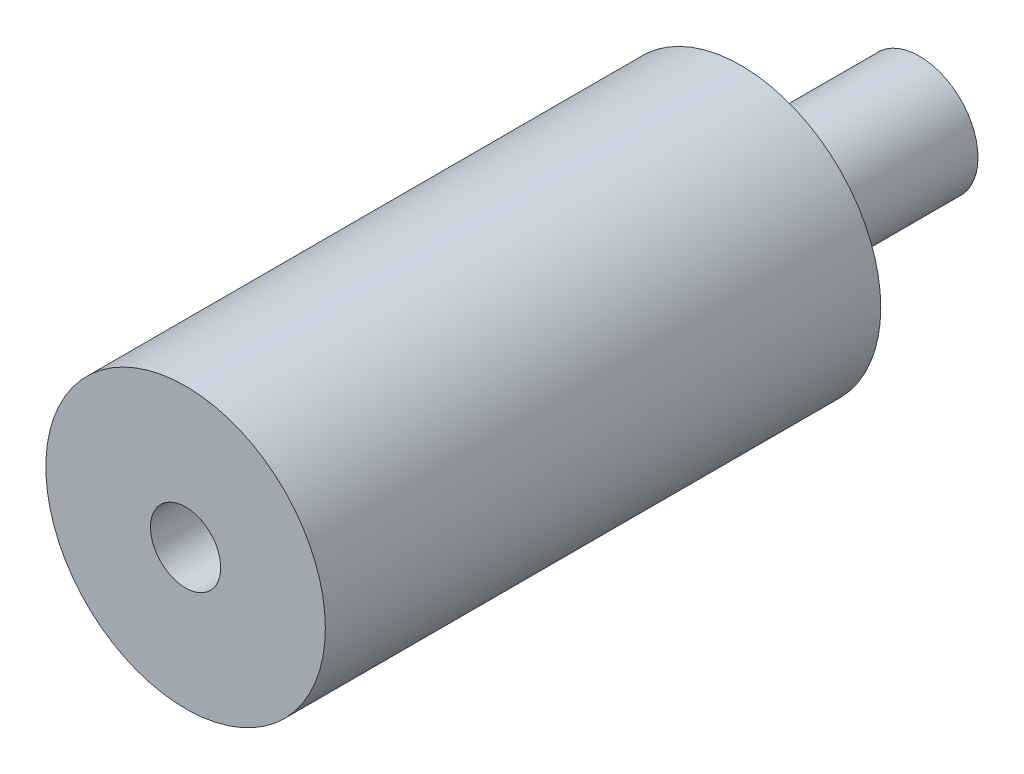
ISO-10303-21;
HEADER;
FILE_DESCRIPTION(('STEP AP214'),'2;1');
FILE_NAME('part.step','',(''),(''),'','','');
FILE_SCHEMA(('AUTOMOTIVE_DESIGN { 1 0 10303 214 1 1 1 1 }'));
ENDSEC;
DATA;
#1=APPLICATION_CONTEXT('core data for automotive mechanical design processes');
#2=APPLICATION_PROTOCOL_DEFINITION('international standard','automotive_design',2000,#1);
#3=PRODUCT_CONTEXT('',#1,'mechanical');
#4=PRODUCT('Part','Part','',(#3));
#5=PRODUCT_RELATED_PRODUCT_CATEGORY('part','',(#4));
#6=PRODUCT_DEFINITION_FORMATION('','',#4);
#7=PRODUCT_DEFINITION_CONTEXT('part definition',#1,'design');
#8=PRODUCT_DEFINITION('design','',#6,#7);
#9=PRODUCT_DEFINITION_SHAPE('','',#8);
#10=(LENGTH_UNIT() NAMED_UNIT(*) SI_UNIT(.MILLI.,.METRE.));
#11=(NAMED_UNIT(*) PLANE_ANGLE_UNIT() SI_UNIT($,.RADIAN.));
#12=(NAMED_UNIT(*) SI_UNIT($,.STERADIAN.) SOLID_ANGLE_UNIT());
#13=UNCERTAINTY_MEASURE_WITH_UNIT(LENGTH_MEASURE(1.E-05),#10,'distance_accuracy_value','');
#14=(GEOMETRIC_REPRESENTATION_CONTEXT(3) GLOBAL_UNCERTAINTY_ASSIGNED_CONTEXT((#13)) GLOBAL_UNIT_ASSIGNED_CONTEXT((#10,
#11,#12)) REPRESENTATION_CONTEXT('',''));
#15=CARTESIAN_POINT('',(0.,0.,0.));
#16=DIRECTION('',(0.,0.,1.));
#17=DIRECTION('',(1.,0.,0.));
#18=AXIS2_PLACEMENT_3D('',#15,#16,#17);
#19=CARTESIAN_POINT('',(0.,0.,0.));
#20=DIRECTION('',(0.,0.,1.));
#21=DIRECTION('',(1.,0.,0.));
#22=AXIS2_PLACEMENT_3D('',#19,#20,#21);
#23=PLANE('',#22);
#24=CARTESIAN_POINT('',(0.,0.,0.));
#25=DIRECTION('',(0.,0.,1.));
#26=DIRECTION('',(1.,0.,0.));
#27=AXIS2_PLACEMENT_3D('',#24,#25,#26);
#28=CIRCLE('',#27,5.969);
#29=CARTESIAN_POINT('',(5.969,0.,0.));
#30=VERTEX_POINT('',#29);
#31=EDGE_CURVE('E369',#30,#30,#28,.T.);
#32=ORIENTED_EDGE('',*,*,#31,.F.);
#33=EDGE_LOOP('',(#32));
#34=FACE_BOUND('',#33,.T.);
#35=CARTESIAN_POINT('',(0.,0.,0.));
#36=DIRECTION('',(0.,0.,1.));
#37=DIRECTION('',(1.,0.,0.));
#38=AXIS2_PLACEMENT_3D('',#35,#36,#37);
#39=CIRCLE('',#38,2.5019);
#40=CARTESIAN_POINT('',(2.5019,0.,0.));
#41=VERTEX_POINT('',#40);
#42=EDGE_CURVE('E10',#41,#41,#39,.F.);
#43=ORIENTED_EDGE('',*,*,#42,.F.);
#44=EDGE_LOOP('',(#43));
#45=FACE_BOUND('',#44,.T.);
#46=ADVANCED_FACE('F358',(#34,#45),#23,.F.);
#47=CARTESIAN_POINT('',(0.,0.,23.7236));
#48=DIRECTION('',(0.,0.,1.));
#49=DIRECTION('',(1.,0.,0.));
#50=AXIS2_PLACEMENT_3D('',#47,#48,#49);
#51=PLANE('',#50);
#52=CARTESIAN_POINT('',(0.,0.,23.7236));
#53=DIRECTION('',(0.,0.,1.));
#54=DIRECTION('',(1.,0.,0.));
#55=AXIS2_PLACEMENT_3D('',#52,#53,#54);
#56=CIRCLE('',#55,5.969);
#57=CARTESIAN_POINT('',(5.969,0.,23.7236));
#58=VERTEX_POINT('',#57);
#59=EDGE_CURVE('E365',#58,#58,#56,.T.);
#60=ORIENTED_EDGE('',*,*,#59,.T.);
#61=EDGE_LOOP('',(#60));
#62=FACE_BOUND('',#61,.T.);
#63=CARTESIAN_POINT('',(0.,0.,23.7236));
#64=DIRECTION('',(0.,0.,1.));
#65=DIRECTION('',(1.,0.,0.));
#66=AXIS2_PLACEMENT_3D('',#63,#64,#65);
#67=CIRCLE('',#66,1.5);
#68=CARTESIAN_POINT('',(1.5,0.,23.7236));
#69=VERTEX_POINT('',#68);
#70=EDGE_CURVE('E373',#69,#69,#67,.T.);
#71=ORIENTED_EDGE('',*,*,#70,.F.);
#72=EDGE_LOOP('',(#71));
#73=FACE_BOUND('',#72,.T.);
#74=ADVANCED_FACE('F401',(#62,#73),#51,.T.);
#75=CARTESIAN_POINT('',(0.,0.,23.7236));
#76=DIRECTION('',(0.,0.,-1.));
#77=DIRECTION('',(-1.,0.,0.));
#78=AXIS2_PLACEMENT_3D('',#75,#76,#77);
#79=CYLINDRICAL_SURFACE('',#78,5.969);
#80=ORIENTED_EDGE('',*,*,#59,.F.);
#81=EDGE_LOOP('',(#80));
#82=FACE_BOUND('',#81,.T.);
#83=ORIENTED_EDGE('',*,*,#31,.T.);
#84=EDGE_LOOP('',(#83));
#85=FACE_BOUND('',#84,.T.);
#86=ADVANCED_FACE('F360',(#82,#85),#79,.T.);
#87=CARTESIAN_POINT('',(0.,0.,23.7236));
#88=DIRECTION('',(0.,0.,-1.));
#89=DIRECTION('',(-1.,0.,0.));
#90=AXIS2_PLACEMENT_3D('',#87,#88,#89);
#91=CYLINDRICAL_SURFACE('',#90,1.5);
#92=ORIENTED_EDGE('',*,*,#70,.T.);
#93=EDGE_LOOP('',(#92));
#94=FACE_BOUND('',#93,.T.);
#95=CARTESIAN_POINT('',(0.,0.,-7.62));
#96=DIRECTION('',(0.,0.,-1.));
#97=DIRECTION('',(-1.,0.,0.));
#98=AXIS2_PLACEMENT_3D('',#95,#96,#97);
#99=CIRCLE('',#98,1.5);
#100=CARTESIAN_POINT('',(-1.5,0.,-7.62));
#101=VERTEX_POINT('',#100);
#102=EDGE_CURVE('E381',#101,#101,#99,.T.);
#103=ORIENTED_EDGE('',*,*,#102,.T.);
#104=EDGE_LOOP('',(#103));
#105=FACE_BOUND('',#104,.T.);
#106=ADVANCED_FACE('F385',(#94,#105),#91,.F.);
#107=CARTESIAN_POINT('',(0.,0.,-7.62));
#108=DIRECTION('',(0.,0.,-1.));
#109=DIRECTION('',(-1.,0.,0.));
#110=AXIS2_PLACEMENT_3D('',#107,#108,#109);
#111=PLANE('',#110);
#112=CARTESIAN_POINT('',(0.,0.,-7.62));
#113=DIRECTION('',(0.,0.,-1.));
#114=DIRECTION('',(-1.,0.,0.));
#115=AXIS2_PLACEMENT_3D('',#112,#113,#114);
#116=CIRCLE('',#115,2.5019);
#117=CARTESIAN_POINT('',(-2.5019,0.,-7.62));
#118=VERTEX_POINT('',#117);
#119=EDGE_CURVE('E378',#118,#118,#116,.T.);
#120=ORIENTED_EDGE('',*,*,#119,.T.);
#121=EDGE_LOOP('',(#120));
#122=FACE_BOUND('',#121,.T.);
#123=ORIENTED_EDGE('',*,*,#102,.F.);
#124=EDGE_LOOP('',(#123));
#125=FACE_BOUND('',#124,.T.);
#126=ADVANCED_FACE('F387',(#122,#125),#111,.T.);
#127=CARTESIAN_POINT('',(0.,0.,-7.62));
#128=DIRECTION('',(0.,0.,1.));
#129=DIRECTION('',(1.,0.,0.));
#130=AXIS2_PLACEMENT_3D('',#127,#128,#129);
#131=CYLINDRICAL_SURFACE('',#130,2.5019);
#132=ORIENTED_EDGE('',*,*,#119,.F.);
#133=EDGE_LOOP('',(#132));
#134=FACE_BOUND('',#133,.T.);
#135=ORIENTED_EDGE('',*,*,#42,.T.);
#136=EDGE_LOOP('',(#135));
#137=FACE_BOUND('',#136,.T.);
#138=ADVANCED_FACE('F389',(#134,#137),#131,.T.);
#139=CLOSED_SHELL('',(#46,#74,#86,#106,#126,#138));
#140=MANIFOLD_SOLID_BREP('B2',#139);
#141=ADVANCED_BREP_SHAPE_REPRESENTATION('',(#18,#140),#14);
#142=SHAPE_DEFINITION_REPRESENTATION(#9,#141);
ENDSEC;
END-ISO-10303-21;
